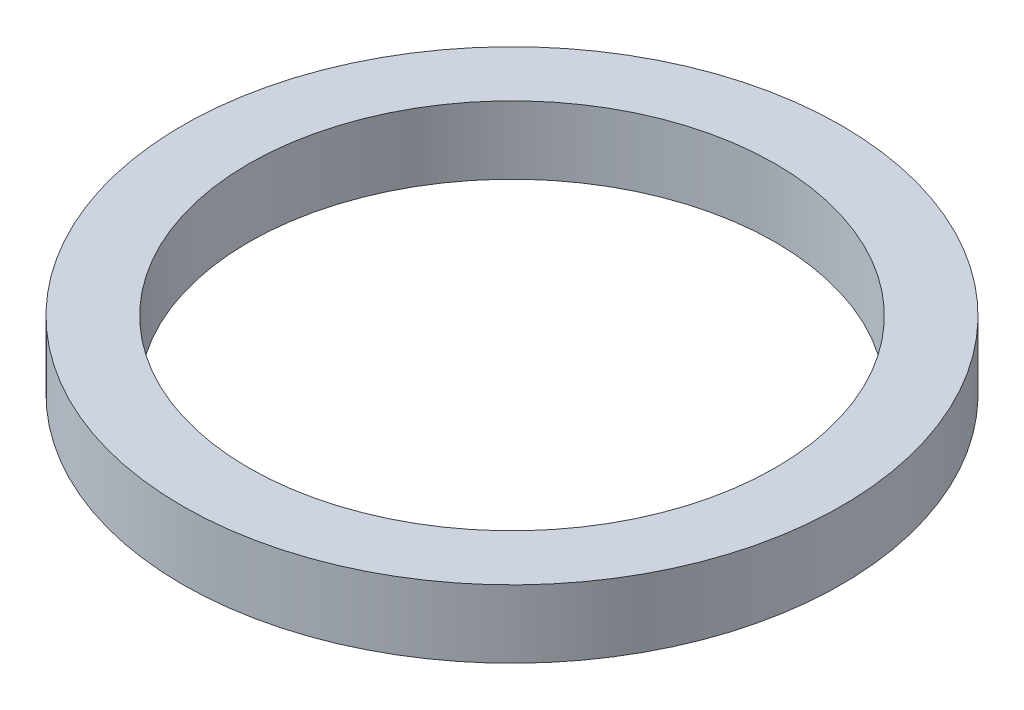
ISO-10303-21;
HEADER;
FILE_DESCRIPTION(('STEP AP214'),'2;1');
FILE_NAME('part.step','',(''),(''),'','','');
FILE_SCHEMA(('AUTOMOTIVE_DESIGN { 1 0 10303 214 1 1 1 1 }'));
ENDSEC;
DATA;
#1=APPLICATION_CONTEXT('core data for automotive mechanical design processes');
#2=APPLICATION_PROTOCOL_DEFINITION('international standard','automotive_design',2000,#1);
#3=PRODUCT_CONTEXT('',#1,'mechanical');
#4=PRODUCT('Part','Part','',(#3));
#5=PRODUCT_RELATED_PRODUCT_CATEGORY('part','',(#4));
#6=PRODUCT_DEFINITION_FORMATION('','',#4);
#7=PRODUCT_DEFINITION_CONTEXT('part definition',#1,'design');
#8=PRODUCT_DEFINITION('design','',#6,#7);
#9=PRODUCT_DEFINITION_SHAPE('','',#8);
#10=(LENGTH_UNIT() NAMED_UNIT(*) SI_UNIT(.MILLI.,.METRE.));
#11=(NAMED_UNIT(*) PLANE_ANGLE_UNIT() SI_UNIT($,.RADIAN.));
#12=(NAMED_UNIT(*) SI_UNIT($,.STERADIAN.) SOLID_ANGLE_UNIT());
#13=UNCERTAINTY_MEASURE_WITH_UNIT(LENGTH_MEASURE(1.E-05),#10,'distance_accuracy_value','');
#14=(GEOMETRIC_REPRESENTATION_CONTEXT(3) GLOBAL_UNCERTAINTY_ASSIGNED_CONTEXT((#13)) GLOBAL_UNIT_ASSIGNED_CONTEXT((#10,
#11,#12)) REPRESENTATION_CONTEXT('',''));
#15=CARTESIAN_POINT('',(0.,0.,0.));
#16=DIRECTION('',(0.,0.,1.));
#17=DIRECTION('',(1.,0.,0.));
#18=AXIS2_PLACEMENT_3D('',#15,#16,#17);
#19=CARTESIAN_POINT('',(0.,2.6162,0.));
#20=DIRECTION('',(0.,1.,0.));
#21=DIRECTION('',(0.,0.,1.));
#22=AXIS2_PLACEMENT_3D('',#19,#20,#21);
#23=PLANE('',#22);
#24=CARTESIAN_POINT('',(0.,2.6162,0.));
#25=DIRECTION('',(0.,1.,0.));
#26=DIRECTION('',(0.,0.,1.));
#27=AXIS2_PLACEMENT_3D('',#24,#25,#26);
#28=CIRCLE('',#27,12.7);
#29=CARTESIAN_POINT('',(0.,2.6162,12.7));
#30=VERTEX_POINT('',#29);
#31=EDGE_CURVE('E10',#30,#30,#28,.T.);
#32=ORIENTED_EDGE('',*,*,#31,.T.);
#33=EDGE_LOOP('',(#32));
#34=FACE_BOUND('',#33,.T.);
#35=CARTESIAN_POINT('',(0.,2.6162,0.));
#36=DIRECTION('',(0.,1.,0.));
#37=DIRECTION('',(0.,0.,1.));
#38=AXIS2_PLACEMENT_3D('',#35,#36,#37);
#39=CIRCLE('',#38,10.1473);
#40=CARTESIAN_POINT('',(0.,2.6162,10.1473));
#41=VERTEX_POINT('',#40);
#42=EDGE_CURVE('E44',#41,#41,#39,.T.);
#43=ORIENTED_EDGE('',*,*,#42,.F.);
#44=EDGE_LOOP('',(#43));
#45=FACE_BOUND('',#44,.T.);
#46=ADVANCED_FACE('F33',(#34,#45),#23,.T.);
#47=CARTESIAN_POINT('',(0.,0.,0.));
#48=DIRECTION('',(0.,1.,0.));
#49=DIRECTION('',(0.,0.,1.));
#50=AXIS2_PLACEMENT_3D('',#47,#48,#49);
#51=PLANE('',#50);
#52=CARTESIAN_POINT('',(0.,0.,0.));
#53=DIRECTION('',(0.,1.,0.));
#54=DIRECTION('',(0.,0.,1.));
#55=AXIS2_PLACEMENT_3D('',#52,#53,#54);
#56=CIRCLE('',#55,12.7);
#57=CARTESIAN_POINT('',(0.,0.,12.7));
#58=VERTEX_POINT('',#57);
#59=EDGE_CURVE('E37',#58,#58,#56,.T.);
#60=ORIENTED_EDGE('',*,*,#59,.F.);
#61=EDGE_LOOP('',(#60));
#62=FACE_BOUND('',#61,.T.);
#63=CARTESIAN_POINT('',(0.,0.,0.));
#64=DIRECTION('',(0.,1.,0.));
#65=DIRECTION('',(0.,0.,1.));
#66=AXIS2_PLACEMENT_3D('',#63,#64,#65);
#67=CIRCLE('',#66,10.1473);
#68=CARTESIAN_POINT('',(0.,0.,10.1473));
#69=VERTEX_POINT('',#68);
#70=EDGE_CURVE('E46',#69,#69,#67,.T.);
#71=ORIENTED_EDGE('',*,*,#70,.T.);
#72=EDGE_LOOP('',(#71));
#73=FACE_BOUND('',#72,.T.);
#74=ADVANCED_FACE('F56',(#62,#73),#51,.F.);
#75=CARTESIAN_POINT('',(0.,2.6162,0.));
#76=DIRECTION('',(0.,-1.,0.));
#77=DIRECTION('',(0.,0.,-1.));
#78=AXIS2_PLACEMENT_3D('',#75,#76,#77);
#79=CYLINDRICAL_SURFACE('',#78,12.7);
#80=ORIENTED_EDGE('',*,*,#31,.F.);
#81=EDGE_LOOP('',(#80));
#82=FACE_BOUND('',#81,.T.);
#83=ORIENTED_EDGE('',*,*,#59,.T.);
#84=EDGE_LOOP('',(#83));
#85=FACE_BOUND('',#84,.T.);
#86=ADVANCED_FACE('F35',(#82,#85),#79,.T.);
#87=CARTESIAN_POINT('',(0.,2.6162,0.));
#88=DIRECTION('',(0.,-1.,0.));
#89=DIRECTION('',(0.,0.,-1.));
#90=AXIS2_PLACEMENT_3D('',#87,#88,#89);
#91=CYLINDRICAL_SURFACE('',#90,10.1473);
#92=ORIENTED_EDGE('',*,*,#42,.T.);
#93=EDGE_LOOP('',(#92));
#94=FACE_BOUND('',#93,.T.);
#95=ORIENTED_EDGE('',*,*,#70,.F.);
#96=EDGE_LOOP('',(#95));
#97=FACE_BOUND('',#96,.T.);
#98=ADVANCED_FACE('F52',(#94,#97),#91,.F.);
#99=CLOSED_SHELL('',(#46,#74,#86,#98));
#100=MANIFOLD_SOLID_BREP('B2',#99);
#101=ADVANCED_BREP_SHAPE_REPRESENTATION('',(#18,#100),#14);
#102=SHAPE_DEFINITION_REPRESENTATION(#9,#101);
ENDSEC;
END-ISO-10303-21;
